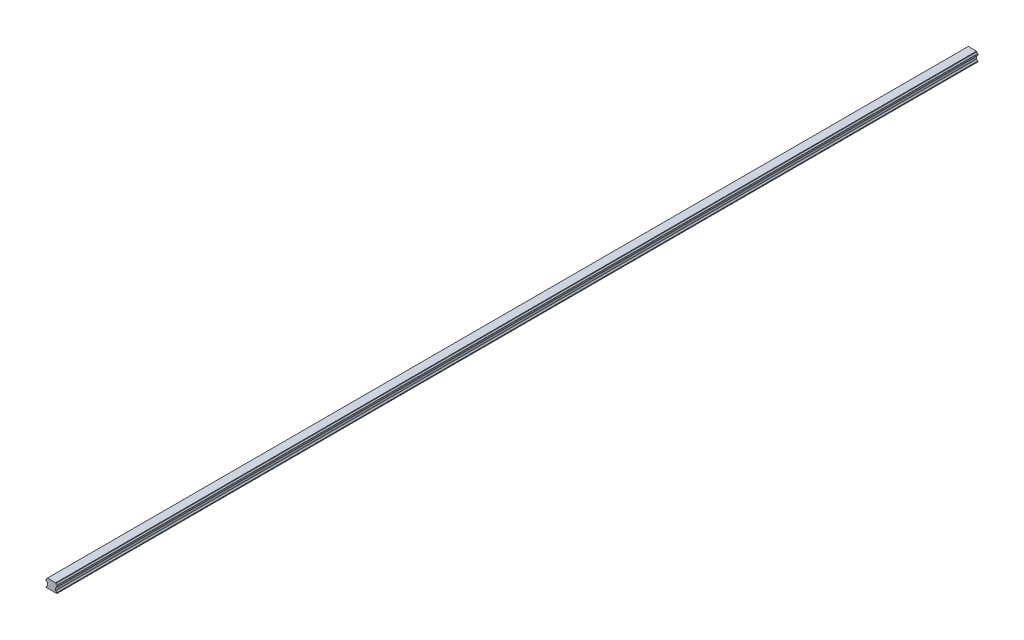
ISO-10303-21;
HEADER;
FILE_DESCRIPTION(('STEP AP214'),'2;1');
FILE_NAME('part.step','',(''),(''),'','','');
FILE_SCHEMA(('AUTOMOTIVE_DESIGN { 1 0 10303 214 1 1 1 1 }'));
ENDSEC;
DATA;
#1=APPLICATION_CONTEXT('core data for automotive mechanical design processes');
#2=APPLICATION_PROTOCOL_DEFINITION('international standard','automotive_design',2000,#1);
#3=PRODUCT_CONTEXT('',#1,'mechanical');
#4=PRODUCT('Part','Part','',(#3));
#5=PRODUCT_RELATED_PRODUCT_CATEGORY('part','',(#4));
#6=PRODUCT_DEFINITION_FORMATION('','',#4);
#7=PRODUCT_DEFINITION_CONTEXT('part definition',#1,'design');
#8=PRODUCT_DEFINITION('design','',#6,#7);
#9=PRODUCT_DEFINITION_SHAPE('','',#8);
#10=(LENGTH_UNIT() NAMED_UNIT(*) SI_UNIT(.MILLI.,.METRE.));
#11=(NAMED_UNIT(*) PLANE_ANGLE_UNIT() SI_UNIT($,.RADIAN.));
#12=(NAMED_UNIT(*) SI_UNIT($,.STERADIAN.) SOLID_ANGLE_UNIT());
#13=UNCERTAINTY_MEASURE_WITH_UNIT(LENGTH_MEASURE(1.E-05),#10,'distance_accuracy_value','');
#14=(GEOMETRIC_REPRESENTATION_CONTEXT(3) GLOBAL_UNCERTAINTY_ASSIGNED_CONTEXT((#13)) GLOBAL_UNIT_ASSIGNED_CONTEXT((#10,
#11,#12)) REPRESENTATION_CONTEXT('',''));
#15=CARTESIAN_POINT('',(0.,0.,0.));
#16=DIRECTION('',(0.,0.,1.));
#17=DIRECTION('',(1.,0.,0.));
#18=AXIS2_PLACEMENT_3D('',#15,#16,#17);
#19=CARTESIAN_POINT('',(-10.0012116020146,-16.2762221715419,1900.));
#20=DIRECTION('',(1.,0.,0.));
#21=DIRECTION('',(0.,0.,-1.));
#22=AXIS2_PLACEMENT_3D('',#19,#20,#21);
#23=PLANE('',#22);
#24=DIRECTION('',(0.,-1.,0.));
#25=VECTOR('',#24,1.);
#26=CARTESIAN_POINT('',(-10.0012116020146,-16.2762221715419,0.));
#27=LINE('',#26,#25);
#28=CARTESIAN_POINT('',(-10.0012116020146,-16.2762221715419,0.));
#29=VERTEX_POINT('',#28);
#30=CARTESIAN_POINT('',(-10.0012116020146,-17.7762221715421,0.));
#31=VERTEX_POINT('',#30);
#32=EDGE_CURVE('E212',#29,#31,#27,.T.);
#33=ORIENTED_EDGE('',*,*,#32,.T.);
#34=DIRECTION('',(0.,0.,-1.));
#35=VECTOR('',#34,1.);
#36=CARTESIAN_POINT('',(-10.0012116020146,-17.7762221715421,1900.));
#37=LINE('',#36,#35);
#38=CARTESIAN_POINT('',(-10.0012116020146,-17.7762221715421,1900.));
#39=VERTEX_POINT('',#38);
#40=EDGE_CURVE('E11',#39,#31,#37,.T.);
#41=ORIENTED_EDGE('',*,*,#40,.F.);
#42=DIRECTION('',(0.,-1.,0.));
#43=VECTOR('',#42,1.);
#44=CARTESIAN_POINT('',(-10.0012116020146,-16.2762221715419,1900.));
#45=LINE('',#44,#43);
#46=CARTESIAN_POINT('',(-10.0012116020146,-16.2762221715419,1900.));
#47=VERTEX_POINT('',#46);
#48=EDGE_CURVE('E254',#47,#39,#45,.T.);
#49=ORIENTED_EDGE('',*,*,#48,.F.);
#50=DIRECTION('',(0.,0.,-1.));
#51=VECTOR('',#50,1.);
#52=CARTESIAN_POINT('',(-10.0012116020146,-16.2762221715419,1900.));
#53=LINE('',#52,#51);
#54=EDGE_CURVE('E208',#47,#29,#53,.T.);
#55=ORIENTED_EDGE('',*,*,#54,.T.);
#56=EDGE_LOOP('',(#33,#41,#49,#55));
#57=FACE_BOUND('',#56,.T.);
#58=ADVANCED_FACE('F32',(#57),#23,.F.);
#59=CARTESIAN_POINT('',(-10.0012116020146,-17.7762221715421,1900.));
#60=DIRECTION('',(0.,1.,0.));
#61=DIRECTION('',(0.,0.,1.));
#62=AXIS2_PLACEMENT_3D('',#59,#60,#61);
#63=PLANE('',#62);
#64=DIRECTION('',(1.,0.,0.));
#65=VECTOR('',#64,1.);
#66=CARTESIAN_POINT('',(-10.0012116020146,-17.7762221715421,0.));
#67=LINE('',#66,#65);
#68=CARTESIAN_POINT('',(11.9987883979856,-17.7762221715421,0.));
#69=VERTEX_POINT('',#68);
#70=EDGE_CURVE('E215',#31,#69,#67,.T.);
#71=ORIENTED_EDGE('',*,*,#70,.T.);
#72=DIRECTION('',(0.,0.,-1.));
#73=VECTOR('',#72,1.);
#74=CARTESIAN_POINT('',(11.9987883979856,-17.7762221715421,1900.));
#75=LINE('',#74,#73);
#76=CARTESIAN_POINT('',(11.9987883979856,-17.7762221715421,1900.));
#77=VERTEX_POINT('',#76);
#78=EDGE_CURVE('E40',#77,#69,#75,.T.);
#79=ORIENTED_EDGE('',*,*,#78,.F.);
#80=DIRECTION('',(1.,0.,0.));
#81=VECTOR('',#80,1.);
#82=CARTESIAN_POINT('',(-10.0012116020146,-17.7762221715421,1900.));
#83=LINE('',#82,#81);
#84=EDGE_CURVE('E133',#39,#77,#83,.T.);
#85=ORIENTED_EDGE('',*,*,#84,.F.);
#86=ORIENTED_EDGE('',*,*,#40,.T.);
#87=EDGE_LOOP('',(#71,#79,#85,#86));
#88=FACE_BOUND('',#87,.T.);
#89=ADVANCED_FACE('F382',(#88),#63,.F.);
#90=CARTESIAN_POINT('',(11.9987883979856,-17.7762221715421,1900.));
#91=DIRECTION('',(-1.,0.,0.));
#92=DIRECTION('',(0.,0.,1.));
#93=AXIS2_PLACEMENT_3D('',#90,#91,#92);
#94=PLANE('',#93);
#95=DIRECTION('',(0.,1.,0.));
#96=VECTOR('',#95,1.);
#97=CARTESIAN_POINT('',(11.9987883979856,-17.7762221715421,0.));
#98=LINE('',#97,#96);
#99=CARTESIAN_POINT('',(11.9987883979856,-16.2762221715418,0.));
#100=VERTEX_POINT('',#99);
#101=EDGE_CURVE('E217',#69,#100,#98,.T.);
#102=ORIENTED_EDGE('',*,*,#101,.T.);
#103=DIRECTION('',(0.,0.,-1.));
#104=VECTOR('',#103,1.);
#105=CARTESIAN_POINT('',(11.9987883979856,-16.2762221715418,1900.));
#106=LINE('',#105,#104);
#107=CARTESIAN_POINT('',(11.9987883979856,-16.2762221715418,1900.));
#108=VERTEX_POINT('',#107);
#109=EDGE_CURVE('E303',#108,#100,#106,.T.);
#110=ORIENTED_EDGE('',*,*,#109,.F.);
#111=DIRECTION('',(0.,1.,0.));
#112=VECTOR('',#111,1.);
#113=CARTESIAN_POINT('',(11.9987883979856,-17.7762221715421,1900.));
#114=LINE('',#113,#112);
#115=EDGE_CURVE('E311',#77,#108,#114,.T.);
#116=ORIENTED_EDGE('',*,*,#115,.F.);
#117=ORIENTED_EDGE('',*,*,#78,.T.);
#118=EDGE_LOOP('',(#102,#110,#116,#117));
#119=FACE_BOUND('',#118,.T.);
#120=ADVANCED_FACE('F309',(#119),#94,.F.);
#121=CARTESIAN_POINT('',(9.49878839798558,-13.7762221715417,1900.));
#122=DIRECTION('',(-0.707106781186547,-0.707106781186547,0.));
#123=DIRECTION('',(0.707106781186548,-0.707106781186548,0.));
#124=AXIS2_PLACEMENT_3D('',#121,#122,#123);
#125=PLANE('',#124);
#126=DIRECTION('',(-0.707106781186548,0.707106781186548,0.));
#127=VECTOR('',#126,1.);
#128=CARTESIAN_POINT('',(9.49878839798558,-13.7762221715417,0.));
#129=LINE('',#128,#127);
#130=CARTESIAN_POINT('',(9.49878839798558,-13.7762221715417,0.));
#131=VERTEX_POINT('',#130);
#132=EDGE_CURVE('E219',#100,#131,#129,.T.);
#133=ORIENTED_EDGE('',*,*,#132,.T.);
#134=DIRECTION('',(0.,0.,-1.));
#135=VECTOR('',#134,1.);
#136=CARTESIAN_POINT('',(9.49878839798558,-13.7762221715417,1900.));
#137=LINE('',#136,#135);
#138=CARTESIAN_POINT('',(9.49878839798558,-13.7762221715417,1900.));
#139=VERTEX_POINT('',#138);
#140=EDGE_CURVE('E300',#139,#131,#137,.T.);
#141=ORIENTED_EDGE('',*,*,#140,.F.);
#142=DIRECTION('',(-0.707106781186548,0.707106781186548,0.));
#143=VECTOR('',#142,1.);
#144=CARTESIAN_POINT('',(9.49878839798558,-13.7762221715417,1900.));
#145=LINE('',#144,#143);
#146=EDGE_CURVE('E329',#108,#139,#145,.T.);
#147=ORIENTED_EDGE('',*,*,#146,.F.);
#148=ORIENTED_EDGE('',*,*,#109,.T.);
#149=EDGE_LOOP('',(#133,#141,#147,#148));
#150=FACE_BOUND('',#149,.T.);
#151=ADVANCED_FACE('F320',(#150),#125,.F.);
#152=CARTESIAN_POINT('',(9.49878839798558,-8.77622217154181,1900.));
#153=DIRECTION('',(-1.,0.,0.));
#154=DIRECTION('',(0.,0.,1.));
#155=AXIS2_PLACEMENT_3D('',#152,#153,#154);
#156=PLANE('',#155);
#157=DIRECTION('',(0.,1.,0.));
#158=VECTOR('',#157,1.);
#159=CARTESIAN_POINT('',(9.49878839798558,-8.77622217154181,0.));
#160=LINE('',#159,#158);
#161=CARTESIAN_POINT('',(9.49878839798558,-8.77622217154181,0.));
#162=VERTEX_POINT('',#161);
#163=EDGE_CURVE('E221',#131,#162,#160,.T.);
#164=ORIENTED_EDGE('',*,*,#163,.T.);
#165=DIRECTION('',(0.,0.,-1.));
#166=VECTOR('',#165,1.);
#167=CARTESIAN_POINT('',(9.49878839798558,-8.77622217154181,1900.));
#168=LINE('',#167,#166);
#169=CARTESIAN_POINT('',(9.49878839798558,-8.77622217154181,1900.));
#170=VERTEX_POINT('',#169);
#171=EDGE_CURVE('E297',#170,#162,#168,.T.);
#172=ORIENTED_EDGE('',*,*,#171,.F.);
#173=DIRECTION('',(0.,1.,0.));
#174=VECTOR('',#173,1.);
#175=CARTESIAN_POINT('',(9.49878839798558,-8.77622217154181,1900.));
#176=LINE('',#175,#174);
#177=EDGE_CURVE('E326',#139,#170,#176,.T.);
#178=ORIENTED_EDGE('',*,*,#177,.F.);
#179=ORIENTED_EDGE('',*,*,#140,.T.);
#180=EDGE_LOOP('',(#164,#172,#178,#179));
#181=FACE_BOUND('',#180,.T.);
#182=ADVANCED_FACE('F324',(#181),#156,.F.);
#183=CARTESIAN_POINT('',(10.0063729844235,-8.26863758510385,1900.));
#184=DIRECTION('',(-0.707106781186547,0.707106781186547,0.));
#185=DIRECTION('',(-0.707106781186548,-0.707106781186548,0.));
#186=AXIS2_PLACEMENT_3D('',#183,#184,#185);
#187=PLANE('',#186);
#188=DIRECTION('',(0.707106781186548,0.707106781186548,0.));
#189=VECTOR('',#188,1.);
#190=CARTESIAN_POINT('',(10.0063729844235,-8.26863758510385,0.));
#191=LINE('',#190,#189);
#192=CARTESIAN_POINT('',(10.0063729844235,-8.26863758510385,0.));
#193=VERTEX_POINT('',#192);
#194=EDGE_CURVE('E223',#162,#193,#191,.T.);
#195=ORIENTED_EDGE('',*,*,#194,.T.);
#196=DIRECTION('',(0.,0.,-1.));
#197=VECTOR('',#196,1.);
#198=CARTESIAN_POINT('',(10.0063729844235,-8.26863758510385,1900.));
#199=LINE('',#198,#197);
#200=CARTESIAN_POINT('',(10.0063729844235,-8.26863758510385,1900.));
#201=VERTEX_POINT('',#200);
#202=EDGE_CURVE('E294',#201,#193,#199,.T.);
#203=ORIENTED_EDGE('',*,*,#202,.F.);
#204=DIRECTION('',(0.707106781186548,0.707106781186548,0.));
#205=VECTOR('',#204,1.);
#206=CARTESIAN_POINT('',(10.0063729844235,-8.26863758510385,1900.));
#207=LINE('',#206,#205);
#208=EDGE_CURVE('E328',#170,#201,#207,.T.);
#209=ORIENTED_EDGE('',*,*,#208,.F.);
#210=ORIENTED_EDGE('',*,*,#171,.T.);
#211=EDGE_LOOP('',(#195,#203,#209,#210));
#212=FACE_BOUND('',#211,.T.);
#213=ADVANCED_FACE('F395',(#212),#187,.F.);
#214=CARTESIAN_POINT('',(12.4987883979856,-8.46322794005069,1900.));
#215=DIRECTION('',(0.,0.,-1.));
#216=DIRECTION('',(-1.,0.,0.));
#217=AXIS2_PLACEMENT_3D('',#214,#215,#216);
#218=CYLINDRICAL_SURFACE('',#217,2.5);
#219=CARTESIAN_POINT('',(12.4987883979856,-8.46322794005069,0.));
#220=DIRECTION('',(0.,0.,-1.));
#221=DIRECTION('',(1.,0.,0.));
#222=AXIS2_PLACEMENT_3D('',#219,#220,#221);
#223=CIRCLE('',#222,2.5);
#224=CARTESIAN_POINT('',(12.3041980430387,-5.97081252648865,0.));
#225=VERTEX_POINT('',#224);
#226=EDGE_CURVE('E225',#193,#225,#223,.T.);
#227=ORIENTED_EDGE('',*,*,#226,.T.);
#228=DIRECTION('',(0.,0.,-1.));
#229=VECTOR('',#228,1.);
#230=CARTESIAN_POINT('',(12.3041980430387,-5.97081252648865,1900.));
#231=LINE('',#230,#229);
#232=CARTESIAN_POINT('',(12.3041980430387,-5.97081252648865,1900.));
#233=VERTEX_POINT('',#232);
#234=EDGE_CURVE('E291',#233,#225,#231,.T.);
#235=ORIENTED_EDGE('',*,*,#234,.F.);
#236=CARTESIAN_POINT('',(12.4987883979856,-8.46322794005069,1900.));
#237=DIRECTION('',(0.,0.,-1.));
#238=DIRECTION('',(1.,0.,0.));
#239=AXIS2_PLACEMENT_3D('',#236,#237,#238);
#240=CIRCLE('',#239,2.5);
#241=EDGE_CURVE('E331',#201,#233,#240,.T.);
#242=ORIENTED_EDGE('',*,*,#241,.F.);
#243=ORIENTED_EDGE('',*,*,#202,.T.);
#244=EDGE_LOOP('',(#227,#235,#242,#243));
#245=FACE_BOUND('',#244,.T.);
#246=ADVANCED_FACE('F398',(#245),#218,.F.);
#247=CARTESIAN_POINT('',(12.4987883979856,-5.77622217154175,1900.));
#248=DIRECTION('',(-0.707106781186548,0.707106781186548,0.));
#249=DIRECTION('',(-0.707106781186548,-0.707106781186548,0.));
#250=AXIS2_PLACEMENT_3D('',#247,#248,#249);
#251=PLANE('',#250);
#252=DIRECTION('',(0.707106781186547,0.707106781186547,0.));
#253=VECTOR('',#252,1.);
#254=CARTESIAN_POINT('',(12.4987883979856,-5.77622217154175,0.));
#255=LINE('',#254,#253);
#256=CARTESIAN_POINT('',(12.4987883979856,-5.77622217154175,0.));
#257=VERTEX_POINT('',#256);
#258=EDGE_CURVE('E227',#225,#257,#255,.T.);
#259=ORIENTED_EDGE('',*,*,#258,.T.);
#260=DIRECTION('',(0.,0.,-1.));
#261=VECTOR('',#260,1.);
#262=CARTESIAN_POINT('',(12.4987883979856,-5.77622217154175,1900.));
#263=LINE('',#262,#261);
#264=CARTESIAN_POINT('',(12.4987883979856,-5.77622217154175,1900.));
#265=VERTEX_POINT('',#264);
#266=EDGE_CURVE('E288',#265,#257,#263,.T.);
#267=ORIENTED_EDGE('',*,*,#266,.F.);
#268=DIRECTION('',(0.707106781186547,0.707106781186547,0.));
#269=VECTOR('',#268,1.);
#270=CARTESIAN_POINT('',(12.4987883979856,-5.77622217154175,1900.));
#271=LINE('',#270,#269);
#272=EDGE_CURVE('E337',#233,#265,#271,.T.);
#273=ORIENTED_EDGE('',*,*,#272,.F.);
#274=ORIENTED_EDGE('',*,*,#234,.T.);
#275=EDGE_LOOP('',(#259,#267,#273,#274));
#276=FACE_BOUND('',#275,.T.);
#277=ADVANCED_FACE('F402',(#276),#251,.F.);
#278=CARTESIAN_POINT('',(12.4987883979856,-2.77622217154181,1900.));
#279=DIRECTION('',(-1.,0.,0.));
#280=DIRECTION('',(0.,0.,1.));
#281=AXIS2_PLACEMENT_3D('',#278,#279,#280);
#282=PLANE('',#281);
#283=DIRECTION('',(0.,1.,0.));
#284=VECTOR('',#283,1.);
#285=CARTESIAN_POINT('',(12.4987883979856,-2.77622217154181,0.));
#286=LINE('',#285,#284);
#287=CARTESIAN_POINT('',(12.4987883979856,-2.77622217154181,0.));
#288=VERTEX_POINT('',#287);
#289=EDGE_CURVE('E229',#257,#288,#286,.T.);
#290=ORIENTED_EDGE('',*,*,#289,.T.);
#291=DIRECTION('',(0.,0.,-1.));
#292=VECTOR('',#291,1.);
#293=CARTESIAN_POINT('',(12.4987883979856,-2.77622217154181,1900.));
#294=LINE('',#293,#292);
#295=CARTESIAN_POINT('',(12.4987883979856,-2.77622217154181,1900.));
#296=VERTEX_POINT('',#295);
#297=EDGE_CURVE('E285',#296,#288,#294,.T.);
#298=ORIENTED_EDGE('',*,*,#297,.F.);
#299=DIRECTION('',(0.,1.,0.));
#300=VECTOR('',#299,1.);
#301=CARTESIAN_POINT('',(12.4987883979856,-2.77622217154181,1900.));
#302=LINE('',#301,#300);
#303=EDGE_CURVE('E339',#265,#296,#302,.T.);
#304=ORIENTED_EDGE('',*,*,#303,.F.);
#305=ORIENTED_EDGE('',*,*,#266,.T.);
#306=EDGE_LOOP('',(#290,#298,#304,#305));
#307=FACE_BOUND('',#306,.T.);
#308=ADVANCED_FACE('F406',(#307),#282,.F.);
#309=CARTESIAN_POINT('',(12.3041980430388,-2.58163181659496,1900.));
#310=DIRECTION('',(-0.707106781186548,-0.707106781186548,0.));
#311=DIRECTION('',(0.707106781186548,-0.707106781186548,0.));
#312=AXIS2_PLACEMENT_3D('',#309,#310,#311);
#313=PLANE('',#312);
#314=DIRECTION('',(-0.707106781186547,0.707106781186547,0.));
#315=VECTOR('',#314,1.);
#316=CARTESIAN_POINT('',(12.3041980430388,-2.58163181659496,0.));
#317=LINE('',#316,#315);
#318=CARTESIAN_POINT('',(12.3041980430388,-2.58163181659496,0.));
#319=VERTEX_POINT('',#318);
#320=EDGE_CURVE('E231',#288,#319,#317,.T.);
#321=ORIENTED_EDGE('',*,*,#320,.T.);
#322=DIRECTION('',(0.,0.,-1.));
#323=VECTOR('',#322,1.);
#324=CARTESIAN_POINT('',(12.3041980430388,-2.58163181659496,1900.));
#325=LINE('',#324,#323);
#326=CARTESIAN_POINT('',(12.3041980430388,-2.58163181659496,1900.));
#327=VERTEX_POINT('',#326);
#328=EDGE_CURVE('E282',#327,#319,#325,.T.);
#329=ORIENTED_EDGE('',*,*,#328,.F.);
#330=DIRECTION('',(-0.707106781186547,0.707106781186547,0.));
#331=VECTOR('',#330,1.);
#332=CARTESIAN_POINT('',(12.3041980430388,-2.58163181659496,1900.));
#333=LINE('',#332,#331);
#334=EDGE_CURVE('E341',#296,#327,#333,.T.);
#335=ORIENTED_EDGE('',*,*,#334,.F.);
#336=ORIENTED_EDGE('',*,*,#297,.T.);
#337=EDGE_LOOP('',(#321,#329,#335,#336));
#338=FACE_BOUND('',#337,.T.);
#339=ADVANCED_FACE('F410',(#338),#313,.F.);
#340=CARTESIAN_POINT('',(12.4987883979856,-0.0892164030329295,1900.));
#341=DIRECTION('',(0.,0.,-1.));
#342=DIRECTION('',(-1.,0.,0.));
#343=AXIS2_PLACEMENT_3D('',#340,#341,#342);
#344=CYLINDRICAL_SURFACE('',#343,2.49999999999998);
#345=CARTESIAN_POINT('',(12.4987883979856,-0.0892164030329295,0.));
#346=DIRECTION('',(0.,0.,-1.));
#347=DIRECTION('',(1.,0.,0.));
#348=AXIS2_PLACEMENT_3D('',#345,#346,#347);
#349=CIRCLE('',#348,2.49999999999998);
#350=CARTESIAN_POINT('',(10.0063729844236,-0.283806757979913,0.));
#351=VERTEX_POINT('',#350);
#352=EDGE_CURVE('E233',#319,#351,#349,.T.);
#353=ORIENTED_EDGE('',*,*,#352,.T.);
#354=DIRECTION('',(0.,0.,-1.));
#355=VECTOR('',#354,1.);
#356=CARTESIAN_POINT('',(10.0063729844236,-0.283806757979913,1900.));
#357=LINE('',#356,#355);
#358=CARTESIAN_POINT('',(10.0063729844236,-0.283806757979913,1900.));
#359=VERTEX_POINT('',#358);
#360=EDGE_CURVE('E279',#359,#351,#357,.T.);
#361=ORIENTED_EDGE('',*,*,#360,.F.);
#362=CARTESIAN_POINT('',(12.4987883979856,-0.0892164030329295,1900.));
#363=DIRECTION('',(0.,0.,-1.));
#364=DIRECTION('',(1.,0.,0.));
#365=AXIS2_PLACEMENT_3D('',#362,#363,#364);
#366=CIRCLE('',#365,2.49999999999998);
#367=EDGE_CURVE('E343',#327,#359,#366,.T.);
#368=ORIENTED_EDGE('',*,*,#367,.F.);
#369=ORIENTED_EDGE('',*,*,#328,.T.);
#370=EDGE_LOOP('',(#353,#361,#368,#369));
#371=FACE_BOUND('',#370,.T.);
#372=ADVANCED_FACE('F414',(#371),#344,.F.);
#373=CARTESIAN_POINT('',(9.49878839798586,0.223777828457852,1900.));
#374=DIRECTION('',(-0.707106781186547,-0.707106781186547,0.));
#375=DIRECTION('',(0.707106781186548,-0.707106781186548,0.));
#376=AXIS2_PLACEMENT_3D('',#373,#374,#375);
#377=PLANE('',#376);
#378=DIRECTION('',(-0.707106781186548,0.707106781186548,0.));
#379=VECTOR('',#378,1.);
#380=CARTESIAN_POINT('',(9.49878839798586,0.223777828457852,0.));
#381=LINE('',#380,#379);
#382=CARTESIAN_POINT('',(9.49878839798586,0.223777828457852,0.));
#383=VERTEX_POINT('',#382);
#384=EDGE_CURVE('E235',#351,#383,#381,.T.);
#385=ORIENTED_EDGE('',*,*,#384,.T.);
#386=DIRECTION('',(0.,0.,-1.));
#387=VECTOR('',#386,1.);
#388=CARTESIAN_POINT('',(9.49878839798586,0.223777828457852,1900.));
#389=LINE('',#388,#387);
#390=CARTESIAN_POINT('',(9.49878839798586,0.223777828457852,1900.));
#391=VERTEX_POINT('',#390);
#392=EDGE_CURVE('E276',#391,#383,#389,.T.);
#393=ORIENTED_EDGE('',*,*,#392,.F.);
#394=DIRECTION('',(-0.707106781186548,0.707106781186548,0.));
#395=VECTOR('',#394,1.);
#396=CARTESIAN_POINT('',(9.49878839798586,0.223777828457852,1900.));
#397=LINE('',#396,#395);
#398=EDGE_CURVE('E345',#359,#391,#397,.T.);
#399=ORIENTED_EDGE('',*,*,#398,.F.);
#400=ORIENTED_EDGE('',*,*,#360,.T.);
#401=EDGE_LOOP('',(#385,#393,#399,#400));
#402=FACE_BOUND('',#401,.T.);
#403=ADVANCED_FACE('F418',(#402),#377,.F.);
#404=CARTESIAN_POINT('',(-7.50121160201476,0.223777828457852,1900.));
#405=DIRECTION('',(0.,-1.,0.));
#406=DIRECTION('',(0.,0.,-1.));
#407=AXIS2_PLACEMENT_3D('',#404,#405,#406);
#408=PLANE('',#407);
#409=DIRECTION('',(-1.,0.,0.));
#410=VECTOR('',#409,1.);
#411=CARTESIAN_POINT('',(-7.50121160201476,0.223777828457852,0.));
#412=LINE('',#411,#410);
#413=CARTESIAN_POINT('',(-7.50121160201476,0.223777828457852,0.));
#414=VERTEX_POINT('',#413);
#415=EDGE_CURVE('E237',#383,#414,#412,.T.);
#416=ORIENTED_EDGE('',*,*,#415,.T.);
#417=DIRECTION('',(0.,0.,-1.));
#418=VECTOR('',#417,1.);
#419=CARTESIAN_POINT('',(-7.50121160201476,0.223777828457852,1900.));
#420=LINE('',#419,#418);
#421=CARTESIAN_POINT('',(-7.50121160201476,0.223777828457852,1900.));
#422=VERTEX_POINT('',#421);
#423=EDGE_CURVE('E273',#422,#414,#420,.T.);
#424=ORIENTED_EDGE('',*,*,#423,.F.);
#425=DIRECTION('',(-1.,0.,0.));
#426=VECTOR('',#425,1.);
#427=CARTESIAN_POINT('',(-7.50121160201476,0.223777828457852,1900.));
#428=LINE('',#427,#426);
#429=EDGE_CURVE('E347',#391,#422,#428,.T.);
#430=ORIENTED_EDGE('',*,*,#429,.F.);
#431=ORIENTED_EDGE('',*,*,#392,.T.);
#432=EDGE_LOOP('',(#416,#424,#430,#431));
#433=FACE_BOUND('',#432,.T.);
#434=ADVANCED_FACE('F422',(#433),#408,.F.);
#435=CARTESIAN_POINT('',(-8.0087961884529,-0.283806757980287,1900.));
#436=DIRECTION('',(0.707106781186549,-0.707106781186546,0.));
#437=DIRECTION('',(0.707106781186546,0.707106781186549,0.));
#438=AXIS2_PLACEMENT_3D('',#435,#436,#437);
#439=PLANE('',#438);
#440=DIRECTION('',(-0.707106781186546,-0.707106781186549,0.));
#441=VECTOR('',#440,1.);
#442=CARTESIAN_POINT('',(-8.0087961884529,-0.283806757980287,0.));
#443=LINE('',#442,#441);
#444=CARTESIAN_POINT('',(-8.00879618845291,-0.283806757980287,0.));
#445=VERTEX_POINT('',#444);
#446=EDGE_CURVE('E239',#414,#445,#443,.T.);
#447=ORIENTED_EDGE('',*,*,#446,.T.);
#448=DIRECTION('',(0.,0.,-1.));
#449=VECTOR('',#448,1.);
#450=CARTESIAN_POINT('',(-8.00879618845291,-0.283806757980287,1900.));
#451=LINE('',#450,#449);
#452=CARTESIAN_POINT('',(-8.00879618845291,-0.283806757980287,1900.));
#453=VERTEX_POINT('',#452);
#454=EDGE_CURVE('E270',#453,#445,#451,.T.);
#455=ORIENTED_EDGE('',*,*,#454,.F.);
#456=DIRECTION('',(-0.707106781186546,-0.707106781186549,0.));
#457=VECTOR('',#456,1.);
#458=CARTESIAN_POINT('',(-8.0087961884529,-0.283806757980287,1900.));
#459=LINE('',#458,#457);
#460=EDGE_CURVE('E349',#422,#453,#459,.T.);
#461=ORIENTED_EDGE('',*,*,#460,.F.);
#462=ORIENTED_EDGE('',*,*,#423,.T.);
#463=EDGE_LOOP('',(#447,#455,#461,#462));
#464=FACE_BOUND('',#463,.T.);
#465=ADVANCED_FACE('F426',(#464),#439,.F.);
#466=CARTESIAN_POINT('',(-10.5012116020148,-0.0892164030332557,1900.));
#467=DIRECTION('',(0.,0.,-1.));
#468=DIRECTION('',(-1.,0.,0.));
#469=AXIS2_PLACEMENT_3D('',#466,#467,#468);
#470=CYLINDRICAL_SURFACE('',#469,2.49999999999983);
#471=CARTESIAN_POINT('',(-10.5012116020148,-0.0892164030332557,0.));
#472=DIRECTION('',(0.,0.,-1.));
#473=DIRECTION('',(1.,0.,0.));
#474=AXIS2_PLACEMENT_3D('',#471,#472,#473);
#475=CIRCLE('',#474,2.49999999999983);
#476=CARTESIAN_POINT('',(-10.3066212470681,-2.58163181659515,0.));
#477=VERTEX_POINT('',#476);
#478=EDGE_CURVE('E241',#445,#477,#475,.T.);
#479=ORIENTED_EDGE('',*,*,#478,.T.);
#480=DIRECTION('',(0.,0.,-1.));
#481=VECTOR('',#480,1.);
#482=CARTESIAN_POINT('',(-10.3066212470681,-2.58163181659515,1900.));
#483=LINE('',#482,#481);
#484=CARTESIAN_POINT('',(-10.3066212470681,-2.58163181659515,1900.));
#485=VERTEX_POINT('',#484);
#486=EDGE_CURVE('E267',#485,#477,#483,.T.);
#487=ORIENTED_EDGE('',*,*,#486,.F.);
#488=CARTESIAN_POINT('',(-10.5012116020148,-0.0892164030332557,1900.));
#489=DIRECTION('',(0.,0.,-1.));
#490=DIRECTION('',(1.,0.,0.));
#491=AXIS2_PLACEMENT_3D('',#488,#489,#490);
#492=CIRCLE('',#491,2.49999999999983);
#493=EDGE_CURVE('E351',#453,#485,#492,.T.);
#494=ORIENTED_EDGE('',*,*,#493,.F.);
#495=ORIENTED_EDGE('',*,*,#454,.T.);
#496=EDGE_LOOP('',(#479,#487,#494,#495));
#497=FACE_BOUND('',#496,.T.);
#498=ADVANCED_FACE('F430',(#497),#470,.F.);
#499=CARTESIAN_POINT('',(-10.5012116020148,-2.77622217154183,1900.));
#500=DIRECTION('',(0.707106781186547,-0.707106781186547,0.));
#501=DIRECTION('',(0.707106781186548,0.707106781186548,0.));
#502=AXIS2_PLACEMENT_3D('',#499,#500,#501);
#503=PLANE('',#502);
#504=DIRECTION('',(-0.707106781186548,-0.707106781186548,0.));
#505=VECTOR('',#504,1.);
#506=CARTESIAN_POINT('',(-10.5012116020148,-2.77622217154183,0.));
#507=LINE('',#506,#505);
#508=CARTESIAN_POINT('',(-10.5012116020148,-2.77622217154183,0.));
#509=VERTEX_POINT('',#508);
#510=EDGE_CURVE('E243',#477,#509,#507,.T.);
#511=ORIENTED_EDGE('',*,*,#510,.T.);
#512=DIRECTION('',(0.,0.,-1.));
#513=VECTOR('',#512,1.);
#514=CARTESIAN_POINT('',(-10.5012116020148,-2.77622217154183,1900.));
#515=LINE('',#514,#513);
#516=CARTESIAN_POINT('',(-10.5012116020148,-2.77622217154183,1900.));
#517=VERTEX_POINT('',#516);
#518=EDGE_CURVE('E264',#517,#509,#515,.T.);
#519=ORIENTED_EDGE('',*,*,#518,.F.);
#520=DIRECTION('',(-0.707106781186548,-0.707106781186548,0.));
#521=VECTOR('',#520,1.);
#522=CARTESIAN_POINT('',(-10.5012116020148,-2.77622217154183,1900.));
#523=LINE('',#522,#521);
#524=EDGE_CURVE('E353',#485,#517,#523,.T.);
#525=ORIENTED_EDGE('',*,*,#524,.F.);
#526=ORIENTED_EDGE('',*,*,#486,.T.);
#527=EDGE_LOOP('',(#511,#519,#525,#526));
#528=FACE_BOUND('',#527,.T.);
#529=ADVANCED_FACE('F434',(#528),#503,.F.);
#530=CARTESIAN_POINT('',(-10.5012116020148,-5.77622217154183,1900.));
#531=DIRECTION('',(1.,0.,0.));
#532=DIRECTION('',(0.,0.,-1.));
#533=AXIS2_PLACEMENT_3D('',#530,#531,#532);
#534=PLANE('',#533);
#535=DIRECTION('',(0.,-1.,0.));
#536=VECTOR('',#535,1.);
#537=CARTESIAN_POINT('',(-10.5012116020148,-5.77622217154183,0.));
#538=LINE('',#537,#536);
#539=CARTESIAN_POINT('',(-10.5012116020148,-5.77622217154183,0.));
#540=VERTEX_POINT('',#539);
#541=EDGE_CURVE('E245',#509,#540,#538,.T.);
#542=ORIENTED_EDGE('',*,*,#541,.T.);
#543=DIRECTION('',(0.,0.,-1.));
#544=VECTOR('',#543,1.);
#545=CARTESIAN_POINT('',(-10.5012116020148,-5.77622217154183,1900.));
#546=LINE('',#545,#544);
#547=CARTESIAN_POINT('',(-10.5012116020148,-5.77622217154183,1900.));
#548=VERTEX_POINT('',#547);
#549=EDGE_CURVE('E261',#548,#540,#546,.T.);
#550=ORIENTED_EDGE('',*,*,#549,.F.);
#551=DIRECTION('',(0.,-1.,0.));
#552=VECTOR('',#551,1.);
#553=CARTESIAN_POINT('',(-10.5012116020148,-5.77622217154183,1900.));
#554=LINE('',#553,#552);
#555=EDGE_CURVE('E355',#517,#548,#554,.T.);
#556=ORIENTED_EDGE('',*,*,#555,.F.);
#557=ORIENTED_EDGE('',*,*,#518,.T.);
#558=EDGE_LOOP('',(#542,#550,#556,#557));
#559=FACE_BOUND('',#558,.T.);
#560=ADVANCED_FACE('F438',(#559),#534,.F.);
#561=CARTESIAN_POINT('',(-10.3066212470679,-5.97081252648868,1900.));
#562=DIRECTION('',(0.707106781186547,0.707106781186547,0.));
#563=DIRECTION('',(-0.707106781186548,0.707106781186548,0.));
#564=AXIS2_PLACEMENT_3D('',#561,#562,#563);
#565=PLANE('',#564);
#566=DIRECTION('',(0.707106781186548,-0.707106781186548,0.));
#567=VECTOR('',#566,1.);
#568=CARTESIAN_POINT('',(-10.3066212470679,-5.97081252648868,0.));
#569=LINE('',#568,#567);
#570=CARTESIAN_POINT('',(-10.3066212470679,-5.97081252648868,0.));
#571=VERTEX_POINT('',#570);
#572=EDGE_CURVE('E247',#540,#571,#569,.T.);
#573=ORIENTED_EDGE('',*,*,#572,.T.);
#574=DIRECTION('',(0.,0.,-1.));
#575=VECTOR('',#574,1.);
#576=CARTESIAN_POINT('',(-10.3066212470679,-5.97081252648868,1900.));
#577=LINE('',#576,#575);
#578=CARTESIAN_POINT('',(-10.3066212470679,-5.97081252648868,1900.));
#579=VERTEX_POINT('',#578);
#580=EDGE_CURVE('E258',#579,#571,#577,.T.);
#581=ORIENTED_EDGE('',*,*,#580,.F.);
#582=DIRECTION('',(0.707106781186548,-0.707106781186548,0.));
#583=VECTOR('',#582,1.);
#584=CARTESIAN_POINT('',(-10.3066212470679,-5.97081252648868,1900.));
#585=LINE('',#584,#583);
#586=EDGE_CURVE('E357',#548,#579,#585,.T.);
#587=ORIENTED_EDGE('',*,*,#586,.F.);
#588=ORIENTED_EDGE('',*,*,#549,.T.);
#589=EDGE_LOOP('',(#573,#581,#587,#588));
#590=FACE_BOUND('',#589,.T.);
#591=ADVANCED_FACE('F363',(#590),#565,.F.);
#592=CARTESIAN_POINT('',(-10.5012116020148,-8.46322794005072,1900.));
#593=DIRECTION('',(0.,0.,-1.));
#594=DIRECTION('',(-1.,0.,0.));
#595=AXIS2_PLACEMENT_3D('',#592,#593,#594);
#596=CYLINDRICAL_SURFACE('',#595,2.5);
#597=CARTESIAN_POINT('',(-10.5012116020148,-8.46322794005072,0.));
#598=DIRECTION('',(0.,0.,-1.));
#599=DIRECTION('',(1.,0.,0.));
#600=AXIS2_PLACEMENT_3D('',#597,#598,#599);
#601=CIRCLE('',#600,2.5);
#602=CARTESIAN_POINT('',(-8.00879618845272,-8.26863758510388,0.));
#603=VERTEX_POINT('',#602);
#604=EDGE_CURVE('E249',#571,#603,#601,.T.);
#605=ORIENTED_EDGE('',*,*,#604,.T.);
#606=DIRECTION('',(0.,0.,-1.));
#607=VECTOR('',#606,1.);
#608=CARTESIAN_POINT('',(-8.00879618845272,-8.26863758510388,1900.));
#609=LINE('',#608,#607);
#610=CARTESIAN_POINT('',(-8.00879618845272,-8.26863758510388,1900.));
#611=VERTEX_POINT('',#610);
#612=EDGE_CURVE('E203',#611,#603,#609,.T.);
#613=ORIENTED_EDGE('',*,*,#612,.F.);
#614=CARTESIAN_POINT('',(-10.5012116020148,-8.46322794005072,1900.));
#615=DIRECTION('',(0.,0.,-1.));
#616=DIRECTION('',(1.,0.,0.));
#617=AXIS2_PLACEMENT_3D('',#614,#615,#616);
#618=CIRCLE('',#617,2.5);
#619=EDGE_CURVE('E194',#579,#611,#618,.T.);
#620=ORIENTED_EDGE('',*,*,#619,.F.);
#621=ORIENTED_EDGE('',*,*,#580,.T.);
#622=EDGE_LOOP('',(#605,#613,#620,#621));
#623=FACE_BOUND('',#622,.T.);
#624=ADVANCED_FACE('F367',(#623),#596,.F.);
#625=CARTESIAN_POINT('',(-7.50121160201465,-8.77622217154195,1900.));
#626=DIRECTION('',(0.707106781186547,0.707106781186547,0.));
#627=DIRECTION('',(-0.707106781186548,0.707106781186548,0.));
#628=AXIS2_PLACEMENT_3D('',#625,#626,#627);
#629=PLANE('',#628);
#630=DIRECTION('',(0.707106781186548,-0.707106781186548,0.));
#631=VECTOR('',#630,1.);
#632=CARTESIAN_POINT('',(-7.50121160201465,-8.77622217154195,0.));
#633=LINE('',#632,#631);
#634=CARTESIAN_POINT('',(-7.50121160201465,-8.77622217154195,0.));
#635=VERTEX_POINT('',#634);
#636=EDGE_CURVE('E202',#603,#635,#633,.T.);
#637=ORIENTED_EDGE('',*,*,#636,.T.);
#638=DIRECTION('',(0.,0.,-1.));
#639=VECTOR('',#638,1.);
#640=CARTESIAN_POINT('',(-7.50121160201465,-8.77622217154195,1900.));
#641=LINE('',#640,#639);
#642=CARTESIAN_POINT('',(-7.50121160201465,-8.77622217154195,1900.));
#643=VERTEX_POINT('',#642);
#644=EDGE_CURVE('E199',#643,#635,#641,.T.);
#645=ORIENTED_EDGE('',*,*,#644,.F.);
#646=DIRECTION('',(0.707106781186548,-0.707106781186548,0.));
#647=VECTOR('',#646,1.);
#648=CARTESIAN_POINT('',(-7.50121160201465,-8.77622217154195,1900.));
#649=LINE('',#648,#647);
#650=EDGE_CURVE('E188',#611,#643,#649,.T.);
#651=ORIENTED_EDGE('',*,*,#650,.F.);
#652=ORIENTED_EDGE('',*,*,#612,.T.);
#653=EDGE_LOOP('',(#637,#645,#651,#652));
#654=FACE_BOUND('',#653,.T.);
#655=ADVANCED_FACE('F200',(#654),#629,.F.);
#656=CARTESIAN_POINT('',(-7.50121160201465,-13.7762221715419,1900.));
#657=DIRECTION('',(1.,0.,0.));
#658=DIRECTION('',(0.,0.,-1.));
#659=AXIS2_PLACEMENT_3D('',#656,#657,#658);
#660=PLANE('',#659);
#661=DIRECTION('',(0.,-1.,0.));
#662=VECTOR('',#661,1.);
#663=CARTESIAN_POINT('',(-7.50121160201465,-13.7762221715419,0.));
#664=LINE('',#663,#662);
#665=CARTESIAN_POINT('',(-7.50121160201465,-13.7762221715419,0.));
#666=VERTEX_POINT('',#665);
#667=EDGE_CURVE('E119',#635,#666,#664,.T.);
#668=ORIENTED_EDGE('',*,*,#667,.T.);
#669=DIRECTION('',(0.,0.,-1.));
#670=VECTOR('',#669,1.);
#671=CARTESIAN_POINT('',(-7.50121160201465,-13.7762221715419,1900.));
#672=LINE('',#671,#670);
#673=CARTESIAN_POINT('',(-7.50121160201465,-13.7762221715419,1900.));
#674=VERTEX_POINT('',#673);
#675=EDGE_CURVE('E204',#674,#666,#672,.T.);
#676=ORIENTED_EDGE('',*,*,#675,.F.);
#677=DIRECTION('',(0.,-1.,0.));
#678=VECTOR('',#677,1.);
#679=CARTESIAN_POINT('',(-7.50121160201465,-13.7762221715419,1900.));
#680=LINE('',#679,#678);
#681=EDGE_CURVE('E192',#643,#674,#680,.T.);
#682=ORIENTED_EDGE('',*,*,#681,.F.);
#683=ORIENTED_EDGE('',*,*,#644,.T.);
#684=EDGE_LOOP('',(#668,#676,#682,#683));
#685=FACE_BOUND('',#684,.T.);
#686=ADVANCED_FACE('F206',(#685),#660,.F.);
#687=CARTESIAN_POINT('',(-10.0012116020146,-16.2762221715419,1900.));
#688=DIRECTION('',(0.707106781186547,-0.707106781186548,0.));
#689=DIRECTION('',(0.707106781186548,0.707106781186547,0.));
#690=AXIS2_PLACEMENT_3D('',#687,#688,#689);
#691=PLANE('',#690);
#692=DIRECTION('',(-0.707106781186548,-0.707106781186547,0.));
#693=VECTOR('',#692,1.);
#694=CARTESIAN_POINT('',(-10.0012116020146,-16.2762221715419,0.));
#695=LINE('',#694,#693);
#696=EDGE_CURVE('E125',#666,#29,#695,.T.);
#697=ORIENTED_EDGE('',*,*,#696,.T.);
#698=ORIENTED_EDGE('',*,*,#54,.F.);
#699=DIRECTION('',(-0.707106781186548,-0.707106781186547,0.));
#700=VECTOR('',#699,1.);
#701=CARTESIAN_POINT('',(-10.0012116020146,-16.2762221715419,1900.));
#702=LINE('',#701,#700);
#703=EDGE_CURVE('E48',#674,#47,#702,.T.);
#704=ORIENTED_EDGE('',*,*,#703,.F.);
#705=ORIENTED_EDGE('',*,*,#675,.T.);
#706=EDGE_LOOP('',(#697,#698,#704,#705));
#707=FACE_BOUND('',#706,.T.);
#708=ADVANCED_FACE('F371',(#707),#691,.F.);
#709=CARTESIAN_POINT('',(12.4987883979856,-8.46322794005069,1900.));
#710=DIRECTION('',(0.,0.,1.));
#711=DIRECTION('',(1.,0.,0.));
#712=AXIS2_PLACEMENT_3D('',#709,#710,#711);
#713=PLANE('',#712);
#714=ORIENTED_EDGE('',*,*,#48,.T.);
#715=ORIENTED_EDGE('',*,*,#84,.T.);
#716=ORIENTED_EDGE('',*,*,#115,.T.);
#717=ORIENTED_EDGE('',*,*,#146,.T.);
#718=ORIENTED_EDGE('',*,*,#177,.T.);
#719=ORIENTED_EDGE('',*,*,#208,.T.);
#720=ORIENTED_EDGE('',*,*,#241,.T.);
#721=ORIENTED_EDGE('',*,*,#272,.T.);
#722=ORIENTED_EDGE('',*,*,#303,.T.);
#723=ORIENTED_EDGE('',*,*,#334,.T.);
#724=ORIENTED_EDGE('',*,*,#367,.T.);
#725=ORIENTED_EDGE('',*,*,#398,.T.);
#726=ORIENTED_EDGE('',*,*,#429,.T.);
#727=ORIENTED_EDGE('',*,*,#460,.T.);
#728=ORIENTED_EDGE('',*,*,#493,.T.);
#729=ORIENTED_EDGE('',*,*,#524,.T.);
#730=ORIENTED_EDGE('',*,*,#555,.T.);
#731=ORIENTED_EDGE('',*,*,#586,.T.);
#732=ORIENTED_EDGE('',*,*,#619,.T.);
#733=ORIENTED_EDGE('',*,*,#650,.T.);
#734=ORIENTED_EDGE('',*,*,#681,.T.);
#735=ORIENTED_EDGE('',*,*,#703,.T.);
#736=EDGE_LOOP('',(#714,#715,#716,#717,#718,#719,#720,#721,#722,#723,#724,#725,#726,#727,#728,
#729,#730,#731,#732,#733,#734,#735));
#737=FACE_BOUND('',#736,.T.);
#738=ADVANCED_FACE('F190',(#737),#713,.T.);
#739=CARTESIAN_POINT('',(12.4987883979856,-8.46322794005069,0.));
#740=DIRECTION('',(0.,0.,1.));
#741=DIRECTION('',(1.,0.,0.));
#742=AXIS2_PLACEMENT_3D('',#739,#740,#741);
#743=PLANE('',#742);
#744=ORIENTED_EDGE('',*,*,#32,.F.);
#745=ORIENTED_EDGE('',*,*,#696,.F.);
#746=ORIENTED_EDGE('',*,*,#667,.F.);
#747=ORIENTED_EDGE('',*,*,#636,.F.);
#748=ORIENTED_EDGE('',*,*,#604,.F.);
#749=ORIENTED_EDGE('',*,*,#572,.F.);
#750=ORIENTED_EDGE('',*,*,#541,.F.);
#751=ORIENTED_EDGE('',*,*,#510,.F.);
#752=ORIENTED_EDGE('',*,*,#478,.F.);
#753=ORIENTED_EDGE('',*,*,#446,.F.);
#754=ORIENTED_EDGE('',*,*,#415,.F.);
#755=ORIENTED_EDGE('',*,*,#384,.F.);
#756=ORIENTED_EDGE('',*,*,#352,.F.);
#757=ORIENTED_EDGE('',*,*,#320,.F.);
#758=ORIENTED_EDGE('',*,*,#289,.F.);
#759=ORIENTED_EDGE('',*,*,#258,.F.);
#760=ORIENTED_EDGE('',*,*,#226,.F.);
#761=ORIENTED_EDGE('',*,*,#194,.F.);
#762=ORIENTED_EDGE('',*,*,#163,.F.);
#763=ORIENTED_EDGE('',*,*,#132,.F.);
#764=ORIENTED_EDGE('',*,*,#101,.F.);
#765=ORIENTED_EDGE('',*,*,#70,.F.);
#766=EDGE_LOOP('',(#744,#745,#746,#747,#748,#749,#750,#751,#752,#753,#754,#755,#756,#757,#758,
#759,#760,#761,#762,#763,#764,#765));
#767=FACE_BOUND('',#766,.T.);
#768=ADVANCED_FACE('F315',(#767),#743,.F.);
#769=CLOSED_SHELL('',(#58,#89,#120,#151,#182,#213,#246,#277,#308,#339,#372,#403,#434,#465,#498,
#529,#560,#591,#624,#655,#686,#708,#738,#768));
#770=MANIFOLD_SOLID_BREP('B2',#769);
#771=ADVANCED_BREP_SHAPE_REPRESENTATION('',(#18,#770),#14);
#772=SHAPE_DEFINITION_REPRESENTATION(#9,#771);
ENDSEC;
END-ISO-10303-21;
